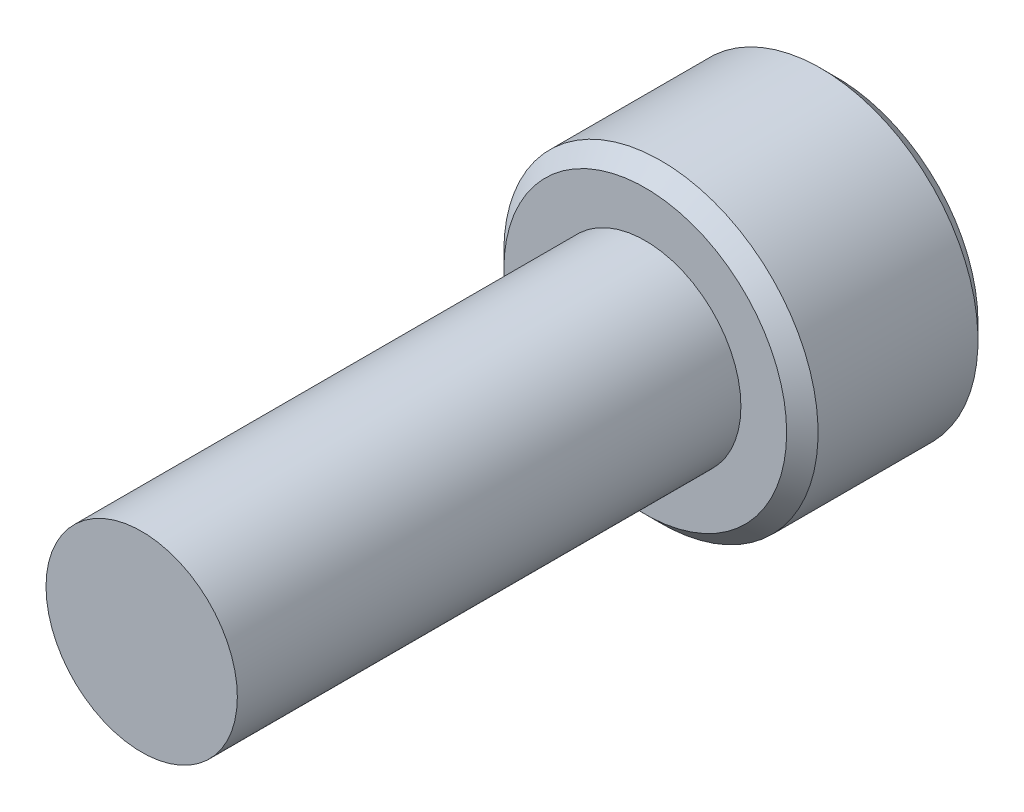
ISO-10303-21;
HEADER;
FILE_DESCRIPTION(('STEP AP214'),'2;1');
FILE_NAME('part.step','',(''),(''),'','','');
FILE_SCHEMA(('AUTOMOTIVE_DESIGN { 1 0 10303 214 1 1 1 1 }'));
ENDSEC;
DATA;
#1=APPLICATION_CONTEXT('core data for automotive mechanical design processes');
#2=APPLICATION_PROTOCOL_DEFINITION('international standard','automotive_design',2000,#1);
#3=PRODUCT_CONTEXT('',#1,'mechanical');
#4=PRODUCT('Part','Part','',(#3));
#5=PRODUCT_RELATED_PRODUCT_CATEGORY('part','',(#4));
#6=PRODUCT_DEFINITION_FORMATION('','',#4);
#7=PRODUCT_DEFINITION_CONTEXT('part definition',#1,'design');
#8=PRODUCT_DEFINITION('design','',#6,#7);
#9=PRODUCT_DEFINITION_SHAPE('','',#8);
#10=(LENGTH_UNIT() NAMED_UNIT(*) SI_UNIT(.MILLI.,.METRE.));
#11=(NAMED_UNIT(*) PLANE_ANGLE_UNIT() SI_UNIT($,.RADIAN.));
#12=(NAMED_UNIT(*) SI_UNIT($,.STERADIAN.) SOLID_ANGLE_UNIT());
#13=UNCERTAINTY_MEASURE_WITH_UNIT(LENGTH_MEASURE(1.E-05),#10,'distance_accuracy_value','');
#14=(GEOMETRIC_REPRESENTATION_CONTEXT(3) GLOBAL_UNCERTAINTY_ASSIGNED_CONTEXT((#13)) GLOBAL_UNIT_ASSIGNED_CONTEXT((#10,
#11,#12)) REPRESENTATION_CONTEXT('',''));
#15=CARTESIAN_POINT('',(0.,0.,0.));
#16=DIRECTION('',(0.,0.,1.));
#17=DIRECTION('',(1.,0.,0.));
#18=AXIS2_PLACEMENT_3D('',#15,#16,#17);
#19=CARTESIAN_POINT('',(0.,0.,-12.7));
#20=DIRECTION('',(0.,0.,1.));
#21=DIRECTION('',(1.,0.,0.));
#22=AXIS2_PLACEMENT_3D('',#19,#20,#21);
#23=CYLINDRICAL_SURFACE('',#22,2.413);
#24=CARTESIAN_POINT('',(0.,0.,-12.7));
#25=DIRECTION('',(0.,0.,-1.));
#26=DIRECTION('',(-1.,0.,0.));
#27=AXIS2_PLACEMENT_3D('',#24,#25,#26);
#28=CIRCLE('',#27,2.413);
#29=CARTESIAN_POINT('',(-2.413,0.,-12.7));
#30=VERTEX_POINT('',#29);
#31=EDGE_CURVE('E205',#30,#30,#28,.F.);
#32=ORIENTED_EDGE('',*,*,#31,.T.);
#33=EDGE_LOOP('',(#32));
#34=FACE_BOUND('',#33,.T.);
#35=CARTESIAN_POINT('',(0.,0.,0.));
#36=DIRECTION('',(0.,0.,1.));
#37=DIRECTION('',(1.,0.,0.));
#38=AXIS2_PLACEMENT_3D('',#35,#36,#37);
#39=CIRCLE('',#38,2.413);
#40=CARTESIAN_POINT('',(2.413,0.,0.));
#41=VERTEX_POINT('',#40);
#42=EDGE_CURVE('E108',#41,#41,#39,.T.);
#43=ORIENTED_EDGE('',*,*,#42,.F.);
#44=EDGE_LOOP('',(#43));
#45=FACE_BOUND('',#44,.T.);
#46=ADVANCED_FACE('F34',(#34,#45),#23,.T.);
#47=CARTESIAN_POINT('',(0.,0.,0.));
#48=DIRECTION('',(0.,0.,1.));
#49=DIRECTION('',(1.,0.,0.));
#50=AXIS2_PLACEMENT_3D('',#47,#48,#49);
#51=PLANE('',#50);
#52=ORIENTED_EDGE('',*,*,#42,.T.);
#53=EDGE_LOOP('',(#52));
#54=FACE_BOUND('',#53,.T.);
#55=ADVANCED_FACE('F192',(#54),#51,.T.);
#56=CARTESIAN_POINT('',(0.,0.,-17.526));
#57=DIRECTION('',(0.,0.,1.));
#58=DIRECTION('',(1.,0.,0.));
#59=AXIS2_PLACEMENT_3D('',#56,#57,#58);
#60=CYLINDRICAL_SURFACE('',#59,3.9624);
#61=CARTESIAN_POINT('',(0.,0.,-17.12976));
#62=DIRECTION('',(0.,0.,-1.));
#63=DIRECTION('',(-1.,0.,0.));
#64=AXIS2_PLACEMENT_3D('',#61,#62,#63);
#65=CIRCLE('',#64,3.9624);
#66=CARTESIAN_POINT('',(-3.9624,0.,-17.12976));
#67=VERTEX_POINT('',#66);
#68=EDGE_CURVE('E42',#67,#67,#65,.F.);
#69=ORIENTED_EDGE('',*,*,#68,.T.);
#70=EDGE_LOOP('',(#69));
#71=FACE_BOUND('',#70,.T.);
#72=CARTESIAN_POINT('',(0.,0.,-13.09624));
#73=DIRECTION('',(0.,0.,-1.));
#74=DIRECTION('',(-1.,0.,0.));
#75=AXIS2_PLACEMENT_3D('',#72,#73,#74);
#76=CIRCLE('',#75,3.9624);
#77=CARTESIAN_POINT('',(-3.9624,0.,-13.09624));
#78=VERTEX_POINT('',#77);
#79=EDGE_CURVE('E171',#78,#78,#76,.T.);
#80=ORIENTED_EDGE('',*,*,#79,.T.);
#81=EDGE_LOOP('',(#80));
#82=FACE_BOUND('',#81,.T.);
#83=ADVANCED_FACE('F176',(#71,#82),#60,.T.);
#84=CARTESIAN_POINT('',(0.,0.,-17.526));
#85=DIRECTION('',(0.,0.,-1.));
#86=DIRECTION('',(-1.,0.,0.));
#87=AXIS2_PLACEMENT_3D('',#84,#85,#86);
#88=PLANE('',#87);
#89=CARTESIAN_POINT('',(0.,0.,-17.526));
#90=DIRECTION('',(0.,0.,-1.));
#91=DIRECTION('',(-1.,0.,0.));
#92=AXIS2_PLACEMENT_3D('',#89,#90,#91);
#93=CIRCLE('',#92,3.56616000000001);
#94=CARTESIAN_POINT('',(-3.56616000000001,0.,-17.526));
#95=VERTEX_POINT('',#94);
#96=EDGE_CURVE('E107',#95,#95,#93,.T.);
#97=ORIENTED_EDGE('',*,*,#96,.T.);
#98=EDGE_LOOP('',(#97));
#99=FACE_BOUND('',#98,.T.);
#100=CARTESIAN_POINT('',(0.,0.,-17.526));
#101=DIRECTION('',(0.,0.,-1.));
#102=DIRECTION('',(-1.,0.,0.));
#103=AXIS2_PLACEMENT_3D('',#100,#101,#102);
#104=CIRCLE('',#103,2.29135888084633);
#105=CARTESIAN_POINT('',(-1.984375,1.14567944042316,-17.526));
#106=VERTEX_POINT('',#105);
#107=CARTESIAN_POINT('',(0.,2.29135888084633,-17.526));
#108=VERTEX_POINT('',#107);
#109=EDGE_CURVE('E88',#106,#108,#104,.T.);
#110=ORIENTED_EDGE('',*,*,#109,.F.);
#111=CARTESIAN_POINT('',(-1.984375,-1.14567944042316,-17.526));
#112=VERTEX_POINT('',#111);
#113=EDGE_CURVE('E48',#112,#106,#104,.T.);
#114=ORIENTED_EDGE('',*,*,#113,.F.);
#115=CARTESIAN_POINT('',(0.,-2.29135888084633,-17.526));
#116=VERTEX_POINT('',#115);
#117=EDGE_CURVE('E264',#116,#112,#104,.T.);
#118=ORIENTED_EDGE('',*,*,#117,.F.);
#119=CARTESIAN_POINT('',(1.984375,-1.14567944042316,-17.526));
#120=VERTEX_POINT('',#119);
#121=EDGE_CURVE('E55',#120,#116,#104,.T.);
#122=ORIENTED_EDGE('',*,*,#121,.F.);
#123=CARTESIAN_POINT('',(1.984375,1.14567944042316,-17.526));
#124=VERTEX_POINT('',#123);
#125=EDGE_CURVE('E129',#124,#120,#104,.T.);
#126=ORIENTED_EDGE('',*,*,#125,.F.);
#127=EDGE_CURVE('E97',#108,#124,#104,.T.);
#128=ORIENTED_EDGE('',*,*,#127,.F.);
#129=EDGE_LOOP('',(#110,#114,#118,#122,#126,#128));
#130=FACE_BOUND('',#129,.T.);
#131=ADVANCED_FACE('F128',(#99,#130),#88,.T.);
#132=CARTESIAN_POINT('',(0.,0.,-12.7));
#133=DIRECTION('',(0.,0.,-1.));
#134=DIRECTION('',(-1.,0.,0.));
#135=AXIS2_PLACEMENT_3D('',#132,#133,#134);
#136=PLANE('',#135);
#137=CARTESIAN_POINT('',(0.,0.,-12.7));
#138=DIRECTION('',(0.,0.,-1.));
#139=DIRECTION('',(-1.,0.,0.));
#140=AXIS2_PLACEMENT_3D('',#137,#138,#139);
#141=CIRCLE('',#140,3.56616);
#142=CARTESIAN_POINT('',(-3.56616,0.,-12.7));
#143=VERTEX_POINT('',#142);
#144=EDGE_CURVE('E11',#143,#143,#141,.F.);
#145=ORIENTED_EDGE('',*,*,#144,.T.);
#146=EDGE_LOOP('',(#145));
#147=FACE_BOUND('',#146,.T.);
#148=ORIENTED_EDGE('',*,*,#31,.F.);
#149=EDGE_LOOP('',(#148));
#150=FACE_BOUND('',#149,.T.);
#151=ADVANCED_FACE('F185',(#147,#150),#136,.F.);
#152=CARTESIAN_POINT('',(0.,0.,-17.526));
#153=DIRECTION('',(0.,0.,-1.));
#154=DIRECTION('',(-1.,0.,0.));
#155=AXIS2_PLACEMENT_3D('',#152,#153,#154);
#156=CONICAL_SURFACE('',#155,2.29135888084633,0.78539816339745);
#157=ORIENTED_EDGE('',*,*,#127,.T.);
#158=CARTESIAN_POINT('',(-0.000199999999999771,2.29147435090016,-17.5261154787818));
#159=CARTESIAN_POINT('',(0.0680159951668023,2.25208982772757,-17.4867628522639));
#160=CARTESIAN_POINT('',(0.137372685106965,2.21204672412052,-17.4497213104462));
#161=CARTESIAN_POINT('',(0.278798800452186,2.13039431835551,-17.3818988584233));
#162=CARTESIAN_POINT('',(0.350881678736781,2.08877724917394,-17.3511556890918));
#163=CARTESIAN_POINT('',(0.496233397266002,2.00485839535392,-17.2984918888112));
#164=CARTESIAN_POINT('',(0.569465212486937,1.96257798712287,-17.27643887588));
#165=CARTESIAN_POINT('',(0.717541182594704,1.87708628592063,-17.2424614929439));
#166=CARTESIAN_POINT('',(0.792380812753423,1.83387760530244,-17.2305117560917));
#167=CARTESIAN_POINT('',(0.921360414543814,1.75941119748879,-17.2197300990819));
#168=CARTESIAN_POINT('',(0.975333715772441,1.72824969749539,-17.2181338990591));
#169=CARTESIAN_POINT('',(1.0831921185198,1.66597761963484,-17.2208218388653));
#170=CARTESIAN_POINT('',(1.13707718248552,1.63486706344893,-17.2251080403405));
#171=CARTESIAN_POINT('',(1.2443385382486,1.57293969082547,-17.2393168730135));
#172=CARTESIAN_POINT('',(1.29771419276014,1.54212324232506,-17.2492458104523));
#173=CARTESIAN_POINT('',(1.4035425174089,1.48102323060122,-17.2741950842745));
#174=CARTESIAN_POINT('',(1.4559952579711,1.45073962671789,-17.2892150303895));
#175=CARTESIAN_POINT('',(1.59035733896365,1.37316564308797,-17.3338078516357));
#176=CARTESIAN_POINT('',(1.67143335715832,1.32635638215845,-17.3667429959383));
#177=CARTESIAN_POINT('',(1.79064830672984,1.25752759893191,-17.4223424412022));
#178=CARTESIAN_POINT('',(1.829934924386,1.23484545965257,-17.4418775920519));
#179=CARTESIAN_POINT('',(1.90778036186805,1.18990137536713,-17.4827287381194));
#180=CARTESIAN_POINT('',(1.9463396111017,1.16763918244233,-17.5040436395684));
#181=CARTESIAN_POINT('',(1.984575,1.14556397036933,-17.5261154787818));
#182=B_SPLINE_CURVE_WITH_KNOTS('',3,(#158,#159,#160,#161,#162,#163,#164,#165,#166,#167,#168,
#169,#170,#171,#172,#173,#174,#175,#176,#177,#178,#179,#180,#181),.UNSPECIFIED.,.F.,.F.,(4,2,2,
2,2,2,2,2,2,2,2,4),(0.,0.264339630306626,0.530219665093693,0.791876416371457,1.05287424418109,
1.239639843932,1.42647091743852,1.61351120244034,1.8005371524754,2.09764209964316,
2.24579179873713,2.39385111134157),.UNSPECIFIED.);
#183=EDGE_CURVE('E102',#108,#124,#182,.T.);
#184=ORIENTED_EDGE('',*,*,#183,.F.);
#185=EDGE_LOOP('',(#157,#184));
#186=FACE_BOUND('',#185,.T.);
#187=ADVANCED_FACE('F103',(#186),#156,.F.);
#188=ORIENTED_EDGE('',*,*,#125,.T.);
#189=CARTESIAN_POINT('',(1.984375,-2.28495242157823,-18.2609840788166));
#190=CARTESIAN_POINT('',(1.984375,-2.22931635455402,-18.2189866855508));
#191=CARTESIAN_POINT('',(1.984375,-2.17336876548389,-18.1773960540763));
#192=CARTESIAN_POINT('',(1.984375,-2.06072770258171,-18.0952084614715));
#193=CARTESIAN_POINT('',(1.984375,-2.00403404503435,-18.054611752405));
#194=CARTESIAN_POINT('',(1.984375,-1.88936329173489,-17.9743035031747));
#195=CARTESIAN_POINT('',(1.984375,-1.83137965519348,-17.9346012588133));
#196=CARTESIAN_POINT('',(1.984375,-1.7144280213784,-17.8566851734013));
#197=CARTESIAN_POINT('',(1.984375,-1.65546009407228,-17.8184712271944));
#198=CARTESIAN_POINT('',(1.984375,-1.47005472306036,-17.7022528340136));
#199=CARTESIAN_POINT('',(1.984375,-1.34163909427884,-17.6273478868724));
#200=CARTESIAN_POINT('',(1.984375,-1.0784038470548,-17.4903302154397));
#201=CARTESIAN_POINT('',(1.984375,-0.943607781407426,-17.4281743664824));
#202=CARTESIAN_POINT('',(1.984375,-0.741275100444882,-17.3521325786886));
#203=CARTESIAN_POINT('',(1.984375,-0.676735408881095,-17.330308061326));
#204=CARTESIAN_POINT('',(1.984375,-0.546098118112761,-17.2918404635378));
#205=CARTESIAN_POINT('',(1.984375,-0.480000411919956,-17.2751977400655));
#206=CARTESIAN_POINT('',(1.984375,-0.347746170028532,-17.2482353808697));
#207=CARTESIAN_POINT('',(1.984375,-0.281612071479123,-17.2378074097359));
#208=CARTESIAN_POINT('',(1.984375,-0.148636620052351,-17.2234781473766));
#209=CARTESIAN_POINT('',(1.984375,-0.0817953907393253,-17.2195757342274));
#210=CARTESIAN_POINT('',(1.984375,0.0495156750890624,-17.2185870513327));
#211=CARTESIAN_POINT('',(1.984375,0.113983775102989,-17.221259178875));
#212=CARTESIAN_POINT('',(1.984375,0.242367515846175,-17.2327392104975));
#213=CARTESIAN_POINT('',(1.984375,0.306283102295918,-17.2415477106392));
#214=CARTESIAN_POINT('',(1.984375,0.434181040262183,-17.2649690213329));
#215=CARTESIAN_POINT('',(1.984375,0.498145026858308,-17.2796806062321));
#216=CARTESIAN_POINT('',(1.984375,0.624675616953006,-17.3141261814121));
#217=CARTESIAN_POINT('',(1.984375,0.687242336899688,-17.3338597514492));
#218=CARTESIAN_POINT('',(1.984375,0.884225483826088,-17.4034122372308));
#219=CARTESIAN_POINT('',(1.984375,1.01583674256468,-17.4611524112565));
#220=CARTESIAN_POINT('',(1.984375,1.27288659242652,-17.5895303365888));
#221=CARTESIAN_POINT('',(1.984375,1.3983008827048,-17.6602144249194));
#222=CARTESIAN_POINT('',(1.984375,1.57956687990221,-17.7705166638132));
#223=CARTESIAN_POINT('',(1.984375,1.63738271299424,-17.8069698294754));
#224=CARTESIAN_POINT('',(1.984375,1.75202215386202,-17.8814159632917));
#225=CARTESIAN_POINT('',(1.984375,1.80884568601362,-17.9194090480781));
#226=CARTESIAN_POINT('',(1.984375,1.92116923084255,-17.9963388088931));
#227=CARTESIAN_POINT('',(1.984375,1.97667624512253,-18.0352653130388));
#228=CARTESIAN_POINT('',(1.984375,2.08693170717166,-18.1141477461214));
#229=CARTESIAN_POINT('',(1.984375,2.14168035934793,-18.154103389024));
#230=CARTESIAN_POINT('',(1.984375,2.19611149046622,-18.1944806112854));
#231=B_SPLINE_CURVE_WITH_KNOTS('',3,(#189,#190,#191,#192,#193,#194,#195,#196,#197,#198,#199,
#200,#201,#202,#203,#204,#205,#206,#207,#208,#209,#210,#211,#212,#213,#214,#215,#216,#217,#218,
#219,#220,#221,#222,#223,#224,#225,#226,#227,#228,#229,#230),.UNSPECIFIED.,.F.,.F.,(4,2,2,2,2,2,
2,2,2,2,2,2,2,2,2,2,2,2,2,2,4),(0.,0.209126070008323,0.418304637356571,0.629103979977991,
0.839888401371184,1.28549951116127,1.72957750768351,1.93379389749972,2.13802435186698,
2.33858179514334,2.53910475350639,2.73236963400794,2.92565329006887,3.12231577097487,
3.31896180041345,3.74886295245172,4.18033428125363,4.3853601718029,4.59040161996383,
4.79377749165108,4.99709743524131),.UNSPECIFIED.);
#232=EDGE_CURVE('E96',#124,#120,#231,.F.);
#233=ORIENTED_EDGE('',*,*,#232,.F.);
#234=EDGE_LOOP('',(#188,#233));
#235=FACE_BOUND('',#234,.T.);
#236=ADVANCED_FACE('F270',(#235),#156,.F.);
#237=ORIENTED_EDGE('',*,*,#121,.T.);
#238=CARTESIAN_POINT('',(1.984575,-1.14556397036933,-17.5261154787818));
#239=CARTESIAN_POINT('',(1.9163590048332,-1.18494849354192,-17.4867628522639));
#240=CARTESIAN_POINT('',(1.84700231489303,-1.22499159714897,-17.4497213104462));
#241=CARTESIAN_POINT('',(1.70557619954781,-1.30664400291398,-17.3818988584233));
#242=CARTESIAN_POINT('',(1.63349332126322,-1.34826107209555,-17.3511556890918));
#243=CARTESIAN_POINT('',(1.488141602734,-1.43217992591557,-17.2984918888112));
#244=CARTESIAN_POINT('',(1.41490978751306,-1.47446033414662,-17.27643887588));
#245=CARTESIAN_POINT('',(1.2668338174053,-1.55995203534886,-17.2424614929439));
#246=CARTESIAN_POINT('',(1.19199418724658,-1.60316071596705,-17.2305117560917));
#247=CARTESIAN_POINT('',(1.06301458545619,-1.6776271237807,-17.2197300990819));
#248=CARTESIAN_POINT('',(1.00904128422756,-1.7087886237741,-17.2181338990591));
#249=CARTESIAN_POINT('',(0.901182881480201,-1.77106070163465,-17.2208218388653));
#250=CARTESIAN_POINT('',(0.847297817514478,-1.80217125782056,-17.2251080403405));
#251=CARTESIAN_POINT('',(0.740036461751398,-1.86409863044402,-17.2393168730135));
#252=CARTESIAN_POINT('',(0.686660807239861,-1.89491507894443,-17.2492458104523));
#253=CARTESIAN_POINT('',(0.580832482591105,-1.95601509066827,-17.2741950842745));
#254=CARTESIAN_POINT('',(0.5283797420289,-1.9862986945516,-17.2892150303895));
#255=CARTESIAN_POINT('',(0.394017661036353,-2.06387267818152,-17.3338078516357));
#256=CARTESIAN_POINT('',(0.312941642841678,-2.11068193911104,-17.3667429959383));
#257=CARTESIAN_POINT('',(0.193726693270162,-2.17951072233758,-17.4223424412022));
#258=CARTESIAN_POINT('',(0.154440075614,-2.20219286161692,-17.4418775920519));
#259=CARTESIAN_POINT('',(0.0765946381319483,-2.24713694590237,-17.4827287381194));
#260=CARTESIAN_POINT('',(0.0380353888983022,-2.26939913882716,-17.5040436395684));
#261=CARTESIAN_POINT('',(-0.000199999999999163,-2.29147435090017,-17.5261154787818));
#262=B_SPLINE_CURVE_WITH_KNOTS('',3,(#238,#239,#240,#241,#242,#243,#244,#245,#246,#247,#248,
#249,#250,#251,#252,#253,#254,#255,#256,#257,#258,#259,#260,#261),.UNSPECIFIED.,.F.,.F.,(4,2,2,
2,2,2,2,2,2,2,2,4),(0.,0.264339630306625,0.530219665093692,0.791876416371457,1.05287424418109,
1.239639843932,1.42647091743852,1.61351120244034,1.8005371524754,2.09764209964316,
2.24579179873713,2.39385111134157),.UNSPECIFIED.);
#263=EDGE_CURVE('E139',#120,#116,#262,.T.);
#264=ORIENTED_EDGE('',*,*,#263,.F.);
#265=EDGE_LOOP('',(#237,#264));
#266=FACE_BOUND('',#265,.T.);
#267=ADVANCED_FACE('F267',(#266),#156,.F.);
#268=ORIENTED_EDGE('',*,*,#117,.T.);
#269=CARTESIAN_POINT('',(0.000200000000000153,-2.29147435090017,-17.5261154787818));
#270=CARTESIAN_POINT('',(-0.0680159951668024,-2.25208982772757,-17.4867628522639));
#271=CARTESIAN_POINT('',(-0.137372685106966,-2.21204672412052,-17.4497213104462));
#272=CARTESIAN_POINT('',(-0.278798800452187,-2.13039431835551,-17.3818988584233));
#273=CARTESIAN_POINT('',(-0.350881678736782,-2.08877724917394,-17.3511556890918));
#274=CARTESIAN_POINT('',(-0.496233397266003,-2.00485839535392,-17.2984918888112));
#275=CARTESIAN_POINT('',(-0.569465212486937,-1.96257798712287,-17.27643887588));
#276=CARTESIAN_POINT('',(-0.717541182594704,-1.87708628592063,-17.2424614929439));
#277=CARTESIAN_POINT('',(-0.792380812753422,-1.83387760530244,-17.2305117560917));
#278=CARTESIAN_POINT('',(-0.921360414543813,-1.75941119748879,-17.2197300990819));
#279=CARTESIAN_POINT('',(-0.97533371577244,-1.72824969749539,-17.2181338990591));
#280=CARTESIAN_POINT('',(-1.0831921185198,-1.66597761963484,-17.2208218388653));
#281=CARTESIAN_POINT('',(-1.13707718248552,-1.63486706344893,-17.2251080403405));
#282=CARTESIAN_POINT('',(-1.2443385382486,-1.57293969082547,-17.2393168730135));
#283=CARTESIAN_POINT('',(-1.29771419276014,-1.54212324232506,-17.2492458104523));
#284=CARTESIAN_POINT('',(-1.40354251740889,-1.48102323060122,-17.2741950842745));
#285=CARTESIAN_POINT('',(-1.4559952579711,-1.45073962671789,-17.2892150303895));
#286=CARTESIAN_POINT('',(-1.59035733896365,-1.37316564308797,-17.3338078516357));
#287=CARTESIAN_POINT('',(-1.67143335715832,-1.32635638215845,-17.3667429959383));
#288=CARTESIAN_POINT('',(-1.79064830672984,-1.25752759893191,-17.4223424412022));
#289=CARTESIAN_POINT('',(-1.829934924386,-1.23484545965257,-17.4418775920519));
#290=CARTESIAN_POINT('',(-1.90778036186805,-1.18990137536713,-17.4827287381194));
#291=CARTESIAN_POINT('',(-1.9463396111017,-1.16763918244233,-17.5040436395684));
#292=CARTESIAN_POINT('',(-1.984575,-1.14556397036933,-17.5261154787818));
#293=B_SPLINE_CURVE_WITH_KNOTS('',3,(#269,#270,#271,#272,#273,#274,#275,#276,#277,#278,#279,
#280,#281,#282,#283,#284,#285,#286,#287,#288,#289,#290,#291,#292),.UNSPECIFIED.,.F.,.F.,(4,2,2,
2,2,2,2,2,2,2,2,4),(0.,0.264339630306627,0.530219665093693,0.791876416371458,1.05287424418109,
1.239639843932,1.42647091743852,1.61351120244034,1.8005371524754,2.09764209964316,
2.24579179873713,2.39385111134157),.UNSPECIFIED.);
#294=EDGE_CURVE('E241',#116,#112,#293,.T.);
#295=ORIENTED_EDGE('',*,*,#294,.F.);
#296=EDGE_LOOP('',(#268,#295));
#297=FACE_BOUND('',#296,.T.);
#298=ADVANCED_FACE('F266',(#297),#156,.F.);
#299=ORIENTED_EDGE('',*,*,#113,.T.);
#300=CARTESIAN_POINT('',(-1.984375,-2.28495242191067,-18.2609840790676));
#301=CARTESIAN_POINT('',(-1.984375,-2.22931635487714,-18.2189866857921));
#302=CARTESIAN_POINT('',(-1.984375,-2.17336876579765,-18.177396054308));
#303=CARTESIAN_POINT('',(-1.984375,-2.06072770287666,-18.0952084616839));
#304=CARTESIAN_POINT('',(-1.984375,-2.00403404531985,-18.0546117526079));
#305=CARTESIAN_POINT('',(-1.984375,-1.88936329200117,-17.9743035033582));
#306=CARTESIAN_POINT('',(-1.984375,-1.83137965544999,-17.9346012589872));
#307=CARTESIAN_POINT('',(-1.984375,-1.71442802161519,-17.856685173556));
#308=CARTESIAN_POINT('',(-1.984375,-1.65546009429911,-17.8184712273396));
#309=CARTESIAN_POINT('',(-1.984375,-1.47005472325436,-17.7022528341287));
#310=CARTESIAN_POINT('',(-1.984375,-1.34163909444949,-17.6273478869673));
#311=CARTESIAN_POINT('',(-1.984375,-1.07840384717678,-17.4903302154972));
#312=CARTESIAN_POINT('',(-1.984375,-0.943607781504097,-17.4281743665226));
#313=CARTESIAN_POINT('',(-1.984375,-0.741275100522509,-17.352132578716));
#314=CARTESIAN_POINT('',(-1.984375,-0.676735408966697,-17.3303080613539));
#315=CARTESIAN_POINT('',(-1.984375,-0.546098118214576,-17.2918404635651));
#316=CARTESIAN_POINT('',(-1.984375,-0.480000412030006,-17.2751977400917));
#317=CARTESIAN_POINT('',(-1.984375,-0.347746170154783,-17.2482353808918));
#318=CARTESIAN_POINT('',(-1.984375,-0.281612071613335,-17.237807409755));
#319=CARTESIAN_POINT('',(-1.984375,-0.148636620202218,-17.2234781473881));
#320=CARTESIAN_POINT('',(-1.984375,-0.0817953908968865,-17.2195757342341));
#321=CARTESIAN_POINT('',(-1.984375,0.0495156749173046,-17.2185870513286));
#322=CARTESIAN_POINT('',(-1.984375,0.113983774924709,-17.221259178865));
#323=CARTESIAN_POINT('',(-1.984375,0.242367515655503,-17.2327392104746));
#324=CARTESIAN_POINT('',(-1.984375,0.306283102099376,-17.2415477106093));
#325=CARTESIAN_POINT('',(-1.984375,0.434181040054053,-17.2649690212885));
#326=CARTESIAN_POINT('',(-1.984375,0.498145026644478,-17.2796806061801));
#327=CARTESIAN_POINT('',(-1.984375,0.624675616728326,-17.3141261813447));
#328=CARTESIAN_POINT('',(-1.984375,0.687242336669858,-17.333859751374));
#329=CARTESIAN_POINT('',(-1.984375,0.884225483546212,-17.4034122371189));
#330=CARTESIAN_POINT('',(-1.984375,1.01583674224242,-17.4611524111108));
#331=CARTESIAN_POINT('',(-1.984375,1.27288659202273,-17.5895303363718));
#332=CARTESIAN_POINT('',(-1.984375,1.3983008822619,-17.6602144246649));
#333=CARTESIAN_POINT('',(-1.984375,1.57956687940504,-17.7705166635036));
#334=CARTESIAN_POINT('',(-1.984375,1.63738271248118,-17.8069698291489));
#335=CARTESIAN_POINT('',(-1.984375,1.75202215331742,-17.8814159629313));
#336=CARTESIAN_POINT('',(-1.984375,1.80884568545336,-17.9194090477007));
#337=CARTESIAN_POINT('',(-1.984375,1.92116923025136,-17.9963388084819));
#338=CARTESIAN_POINT('',(-1.984375,1.97667624451606,-18.0352653126108));
#339=CARTESIAN_POINT('',(-1.984375,2.08693170653473,-18.1141477456598));
#340=CARTESIAN_POINT('',(-1.984375,2.14168035869581,-18.1541033885457));
#341=CARTESIAN_POINT('',(-1.984375,2.19611148979895,-18.1944806107903));
#342=B_SPLINE_CURVE_WITH_KNOTS('',3,(#300,#301,#302,#303,#304,#305,#306,#307,#308,#309,#310,
#311,#312,#313,#314,#315,#316,#317,#318,#319,#320,#321,#322,#323,#324,#325,#326,#327,#328,#329,
#330,#331,#332,#333,#334,#335,#336,#337,#338,#339,#340,#341),.UNSPECIFIED.,.F.,.F.,(4,2,2,2,2,2,
2,2,2,2,2,2,2,2,2,2,2,2,2,2,4),(0.,0.209126070048129,0.418304637436191,0.629103980098179,
0.83988840153193,1.28549951141298,1.72957750802533,1.93379389781847,2.13802435216272,
2.33858179541699,2.53910475375796,2.7323696342393,2.92565329027999,3.12231577116422,
3.31896180058102,3.74886295246281,4.18033428110719,4.38536017158909,4.59040161968262,
4.7937774913034,4.99709743482717),.UNSPECIFIED.);
#343=EDGE_CURVE('E118',#112,#106,#342,.T.);
#344=ORIENTED_EDGE('',*,*,#343,.F.);
#345=EDGE_LOOP('',(#299,#344));
#346=FACE_BOUND('',#345,.T.);
#347=ADVANCED_FACE('F279',(#346),#156,.F.);
#348=ORIENTED_EDGE('',*,*,#109,.T.);
#349=CARTESIAN_POINT('',(-1.984575,1.14556397036933,-17.5261154787818));
#350=CARTESIAN_POINT('',(-1.9163590048332,1.18494849354192,-17.4867628522639));
#351=CARTESIAN_POINT('',(-1.84700231489303,1.22499159714897,-17.4497213104462));
#352=CARTESIAN_POINT('',(-1.70557619954781,1.30664400291398,-17.3818988584233));
#353=CARTESIAN_POINT('',(-1.63349332126322,1.34826107209555,-17.3511556890918));
#354=CARTESIAN_POINT('',(-1.488141602734,1.43217992591557,-17.2984918888112));
#355=CARTESIAN_POINT('',(-1.41490978751306,1.47446033414662,-17.27643887588));
#356=CARTESIAN_POINT('',(-1.2668338174053,1.55995203534886,-17.2424614929439));
#357=CARTESIAN_POINT('',(-1.19199418724658,1.60316071596705,-17.2305117560917));
#358=CARTESIAN_POINT('',(-1.06301458545619,1.6776271237807,-17.2197300990819));
#359=CARTESIAN_POINT('',(-1.00904128422756,1.7087886237741,-17.2181338990591));
#360=CARTESIAN_POINT('',(-0.901182881480202,1.77106070163465,-17.2208218388653));
#361=CARTESIAN_POINT('',(-0.847297817514479,1.80217125782056,-17.2251080403405));
#362=CARTESIAN_POINT('',(-0.740036461751398,1.86409863044402,-17.2393168730135));
#363=CARTESIAN_POINT('',(-0.686660807239862,1.89491507894443,-17.2492458104523));
#364=CARTESIAN_POINT('',(-0.580832482591106,1.95601509066827,-17.2741950842745));
#365=CARTESIAN_POINT('',(-0.528379742028901,1.9862986945516,-17.2892150303895));
#366=CARTESIAN_POINT('',(-0.394017661036353,2.06387267818152,-17.3338078516357));
#367=CARTESIAN_POINT('',(-0.312941642841678,2.11068193911104,-17.3667429959383));
#368=CARTESIAN_POINT('',(-0.193726693270161,2.17951072233758,-17.4223424412022));
#369=CARTESIAN_POINT('',(-0.154440075613999,2.20219286161692,-17.4418775920519));
#370=CARTESIAN_POINT('',(-0.0765946381319469,2.24713694590237,-17.4827287381194));
#371=CARTESIAN_POINT('',(-0.0380353888983006,2.26939913882716,-17.5040436395684));
#372=CARTESIAN_POINT('',(0.000200000000000925,2.29147435090016,-17.5261154787818));
#373=B_SPLINE_CURVE_WITH_KNOTS('',3,(#349,#350,#351,#352,#353,#354,#355,#356,#357,#358,#359,
#360,#361,#362,#363,#364,#365,#366,#367,#368,#369,#370,#371,#372),.UNSPECIFIED.,.F.,.F.,(4,2,2,
2,2,2,2,2,2,2,2,4),(0.,0.264339630306627,0.530219665093693,0.791876416371457,1.05287424418109,
1.239639843932,1.42647091743852,1.61351120244034,1.8005371524754,2.09764209964316,
2.24579179873713,2.39385111134157),.UNSPECIFIED.);
#374=EDGE_CURVE('E92',#106,#108,#373,.T.);
#375=ORIENTED_EDGE('',*,*,#374,.F.);
#376=EDGE_LOOP('',(#348,#375));
#377=FACE_BOUND('',#376,.T.);
#378=ADVANCED_FACE('F90',(#377),#156,.F.);
#379=CARTESIAN_POINT('',(1.984375,3.43703832126949,-14.5494375));
#380=DIRECTION('',(0.,0.,-1.));
#381=DIRECTION('',(-1.,0.,0.));
#382=AXIS2_PLACEMENT_3D('',#379,#380,#381);
#383=PLANE('',#382);
#384=DIRECTION('',(0.866025403784439,0.5,0.));
#385=VECTOR('',#384,1.);
#386=CARTESIAN_POINT('',(-1.984375,1.14567944042316,-14.5494375));
#387=LINE('',#386,#385);
#388=CARTESIAN_POINT('',(-1.984375,1.14567944042316,-14.5494375));
#389=VERTEX_POINT('',#388);
#390=CARTESIAN_POINT('',(0.,2.29135888084633,-14.5494375));
#391=VERTEX_POINT('',#390);
#392=EDGE_CURVE('E117',#389,#391,#387,.T.);
#393=ORIENTED_EDGE('',*,*,#392,.T.);
#394=DIRECTION('',(0.866025403784439,-0.5,0.));
#395=VECTOR('',#394,1.);
#396=CARTESIAN_POINT('',(0.,2.29135888084633,-14.5494375));
#397=LINE('',#396,#395);
#398=CARTESIAN_POINT('',(1.984375,1.14567944042316,-14.5494375));
#399=VERTEX_POINT('',#398);
#400=EDGE_CURVE('E122',#391,#399,#397,.T.);
#401=ORIENTED_EDGE('',*,*,#400,.T.);
#402=DIRECTION('',(0.,-1.,0.));
#403=VECTOR('',#402,1.);
#404=CARTESIAN_POINT('',(1.984375,1.14567944042316,-14.5494375));
#405=LINE('',#404,#403);
#406=CARTESIAN_POINT('',(1.984375,-1.14567944042316,-14.5494375));
#407=VERTEX_POINT('',#406);
#408=EDGE_CURVE('E227',#399,#407,#405,.T.);
#409=ORIENTED_EDGE('',*,*,#408,.T.);
#410=DIRECTION('',(-0.866025403784439,-0.5,0.));
#411=VECTOR('',#410,1.);
#412=CARTESIAN_POINT('',(1.984375,-1.14567944042316,-14.5494375));
#413=LINE('',#412,#411);
#414=CARTESIAN_POINT('',(0.,-2.29135888084633,-14.5494375));
#415=VERTEX_POINT('',#414);
#416=EDGE_CURVE('E224',#407,#415,#413,.T.);
#417=ORIENTED_EDGE('',*,*,#416,.T.);
#418=DIRECTION('',(-0.866025403784439,0.5,0.));
#419=VECTOR('',#418,1.);
#420=CARTESIAN_POINT('',(0.,-2.29135888084633,-14.5494375));
#421=LINE('',#420,#419);
#422=CARTESIAN_POINT('',(-1.984375,-1.14567944042316,-14.5494375));
#423=VERTEX_POINT('',#422);
#424=EDGE_CURVE('E221',#415,#423,#421,.T.);
#425=ORIENTED_EDGE('',*,*,#424,.T.);
#426=DIRECTION('',(0.,1.,0.));
#427=VECTOR('',#426,1.);
#428=CARTESIAN_POINT('',(-1.984375,-1.14567944042316,-14.5494375));
#429=LINE('',#428,#427);
#430=EDGE_CURVE('E125',#423,#389,#429,.T.);
#431=ORIENTED_EDGE('',*,*,#430,.T.);
#432=EDGE_LOOP('',(#393,#401,#409,#417,#425,#431));
#433=FACE_BOUND('',#432,.T.);
#434=ADVANCED_FACE('F159',(#433),#383,.T.);
#435=CARTESIAN_POINT('',(0.,2.29135888084633,-14.5494375));
#436=DIRECTION('',(0.5,0.866025403784439,0.));
#437=DIRECTION('',(-0.866025403784439,0.5,0.));
#438=AXIS2_PLACEMENT_3D('',#435,#436,#437);
#439=PLANE('',#438);
#440=DIRECTION('',(0.,0.,-1.));
#441=VECTOR('',#440,1.);
#442=CARTESIAN_POINT('',(0.,2.29135888084633,-14.5494375));
#443=LINE('',#442,#441);
#444=EDGE_CURVE('E114',#391,#108,#443,.T.);
#445=ORIENTED_EDGE('',*,*,#444,.T.);
#446=ORIENTED_EDGE('',*,*,#183,.T.);
#447=DIRECTION('',(0.,0.,-1.));
#448=VECTOR('',#447,1.);
#449=CARTESIAN_POINT('',(1.984375,1.14567944042316,-14.5494375));
#450=LINE('',#449,#448);
#451=EDGE_CURVE('E124',#399,#124,#450,.T.);
#452=ORIENTED_EDGE('',*,*,#451,.F.);
#453=ORIENTED_EDGE('',*,*,#400,.F.);
#454=EDGE_LOOP('',(#445,#446,#452,#453));
#455=FACE_BOUND('',#454,.T.);
#456=ADVANCED_FACE('F120',(#455),#439,.F.);
#457=CARTESIAN_POINT('',(1.984375,1.14567944042316,-14.5494375));
#458=DIRECTION('',(1.,0.,0.));
#459=DIRECTION('',(0.,0.,-1.));
#460=AXIS2_PLACEMENT_3D('',#457,#458,#459);
#461=PLANE('',#460);
#462=ORIENTED_EDGE('',*,*,#451,.T.);
#463=ORIENTED_EDGE('',*,*,#232,.T.);
#464=DIRECTION('',(0.,0.,-1.));
#465=VECTOR('',#464,1.);
#466=CARTESIAN_POINT('',(1.984375,-1.14567944042316,-14.5494375));
#467=LINE('',#466,#465);
#468=EDGE_CURVE('E212',#407,#120,#467,.T.);
#469=ORIENTED_EDGE('',*,*,#468,.F.);
#470=ORIENTED_EDGE('',*,*,#408,.F.);
#471=EDGE_LOOP('',(#462,#463,#469,#470));
#472=FACE_BOUND('',#471,.T.);
#473=ADVANCED_FACE('F148',(#472),#461,.F.);
#474=CARTESIAN_POINT('',(1.984375,-1.14567944042316,-14.5494375));
#475=DIRECTION('',(0.5,-0.866025403784439,0.));
#476=DIRECTION('',(0.866025403784439,0.5,0.));
#477=AXIS2_PLACEMENT_3D('',#474,#475,#476);
#478=PLANE('',#477);
#479=ORIENTED_EDGE('',*,*,#468,.T.);
#480=ORIENTED_EDGE('',*,*,#263,.T.);
#481=DIRECTION('',(0.,0.,-1.));
#482=VECTOR('',#481,1.);
#483=CARTESIAN_POINT('',(0.,-2.29135888084633,-14.5494375));
#484=LINE('',#483,#482);
#485=EDGE_CURVE('E215',#415,#116,#484,.T.);
#486=ORIENTED_EDGE('',*,*,#485,.F.);
#487=ORIENTED_EDGE('',*,*,#416,.F.);
#488=EDGE_LOOP('',(#479,#480,#486,#487));
#489=FACE_BOUND('',#488,.T.);
#490=ADVANCED_FACE('F152',(#489),#478,.F.);
#491=CARTESIAN_POINT('',(0.,-2.29135888084633,-14.5494375));
#492=DIRECTION('',(-0.5,-0.866025403784439,0.));
#493=DIRECTION('',(0.866025403784439,-0.5,0.));
#494=AXIS2_PLACEMENT_3D('',#491,#492,#493);
#495=PLANE('',#494);
#496=ORIENTED_EDGE('',*,*,#485,.T.);
#497=ORIENTED_EDGE('',*,*,#294,.T.);
#498=DIRECTION('',(0.,0.,-1.));
#499=VECTOR('',#498,1.);
#500=CARTESIAN_POINT('',(-1.984375,-1.14567944042316,-14.5494375));
#501=LINE('',#500,#499);
#502=EDGE_CURVE('E208',#423,#112,#501,.T.);
#503=ORIENTED_EDGE('',*,*,#502,.F.);
#504=ORIENTED_EDGE('',*,*,#424,.F.);
#505=EDGE_LOOP('',(#496,#497,#503,#504));
#506=FACE_BOUND('',#505,.T.);
#507=ADVANCED_FACE('F249',(#506),#495,.F.);
#508=CARTESIAN_POINT('',(-1.984375,-1.14567944042316,-14.5494375));
#509=DIRECTION('',(-1.,0.,0.));
#510=DIRECTION('',(0.,-1.,0.));
#511=AXIS2_PLACEMENT_3D('',#508,#509,#510);
#512=PLANE('',#511);
#513=ORIENTED_EDGE('',*,*,#502,.T.);
#514=ORIENTED_EDGE('',*,*,#343,.T.);
#515=DIRECTION('',(0.,0.,-1.));
#516=VECTOR('',#515,1.);
#517=CARTESIAN_POINT('',(-1.984375,1.14567944042316,-14.5494375));
#518=LINE('',#517,#516);
#519=EDGE_CURVE('E116',#389,#106,#518,.T.);
#520=ORIENTED_EDGE('',*,*,#519,.F.);
#521=ORIENTED_EDGE('',*,*,#430,.F.);
#522=EDGE_LOOP('',(#513,#514,#520,#521));
#523=FACE_BOUND('',#522,.T.);
#524=ADVANCED_FACE('F246',(#523),#512,.F.);
#525=CARTESIAN_POINT('',(-1.984375,1.14567944042316,-14.5494375));
#526=DIRECTION('',(-0.5,0.866025403784439,0.));
#527=DIRECTION('',(-0.866025403784439,-0.5,0.));
#528=AXIS2_PLACEMENT_3D('',#525,#526,#527);
#529=PLANE('',#528);
#530=ORIENTED_EDGE('',*,*,#519,.T.);
#531=ORIENTED_EDGE('',*,*,#374,.T.);
#532=ORIENTED_EDGE('',*,*,#444,.F.);
#533=ORIENTED_EDGE('',*,*,#392,.F.);
#534=EDGE_LOOP('',(#530,#531,#532,#533));
#535=FACE_BOUND('',#534,.T.);
#536=ADVANCED_FACE('F112',(#535),#529,.F.);
#537=CARTESIAN_POINT('',(0.,0.,-17.526));
#538=DIRECTION('',(0.,0.,1.));
#539=DIRECTION('',(1.,0.,0.));
#540=AXIS2_PLACEMENT_3D('',#537,#538,#539);
#541=CONICAL_SURFACE('',#540,3.56616000000001,0.785398163397442);
#542=ORIENTED_EDGE('',*,*,#68,.F.);
#543=EDGE_LOOP('',(#542));
#544=FACE_BOUND('',#543,.T.);
#545=ORIENTED_EDGE('',*,*,#96,.F.);
#546=EDGE_LOOP('',(#545));
#547=FACE_BOUND('',#546,.T.);
#548=ADVANCED_FACE('F179',(#544,#547),#541,.T.);
#549=CARTESIAN_POINT('',(0.,0.,-13.09624));
#550=DIRECTION('',(0.,0.,-1.));
#551=DIRECTION('',(-1.,0.,0.));
#552=AXIS2_PLACEMENT_3D('',#549,#550,#551);
#553=CONICAL_SURFACE('',#552,3.9624,0.785398163397448);
#554=ORIENTED_EDGE('',*,*,#144,.F.);
#555=EDGE_LOOP('',(#554));
#556=FACE_BOUND('',#555,.T.);
#557=ORIENTED_EDGE('',*,*,#79,.F.);
#558=EDGE_LOOP('',(#557));
#559=FACE_BOUND('',#558,.T.);
#560=ADVANCED_FACE('F36',(#556,#559),#553,.T.);
#561=CLOSED_SHELL('',(#46,#55,#83,#131,#151,#187,#236,#267,#298,#347,#378,#434,#456,#473,#490,
#507,#524,#536,#548,#560));
#562=MANIFOLD_SOLID_BREP('B2',#561);
#563=ADVANCED_BREP_SHAPE_REPRESENTATION('',(#18,#562),#14);
#564=SHAPE_DEFINITION_REPRESENTATION(#9,#563);
ENDSEC;
END-ISO-10303-21;
